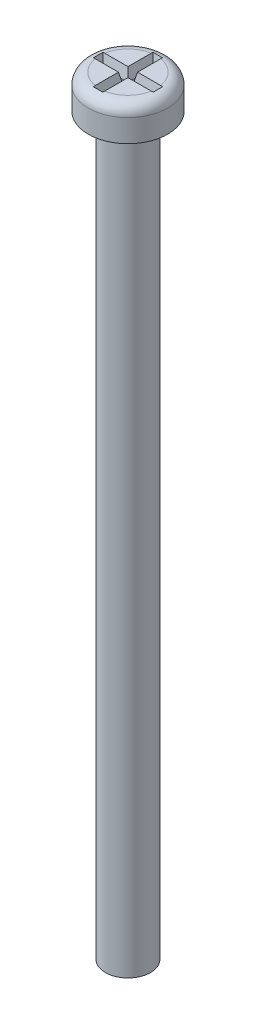
ISO-10303-21;
HEADER;
FILE_DESCRIPTION(('STEP AP214'),'2;1');
FILE_NAME('part.step','',(''),(''),'','','');
FILE_SCHEMA(('AUTOMOTIVE_DESIGN { 1 0 10303 214 1 1 1 1 }'));
ENDSEC;
DATA;
#1=APPLICATION_CONTEXT('core data for automotive mechanical design processes');
#2=APPLICATION_PROTOCOL_DEFINITION('international standard','automotive_design',2000,#1);
#3=PRODUCT_CONTEXT('',#1,'mechanical');
#4=PRODUCT('Part','Part','',(#3));
#5=PRODUCT_RELATED_PRODUCT_CATEGORY('part','',(#4));
#6=PRODUCT_DEFINITION_FORMATION('','',#4);
#7=PRODUCT_DEFINITION_CONTEXT('part definition',#1,'design');
#8=PRODUCT_DEFINITION('design','',#6,#7);
#9=PRODUCT_DEFINITION_SHAPE('','',#8);
#10=(LENGTH_UNIT() NAMED_UNIT(*) SI_UNIT(.MILLI.,.METRE.));
#11=(NAMED_UNIT(*) PLANE_ANGLE_UNIT() SI_UNIT($,.RADIAN.));
#12=(NAMED_UNIT(*) SI_UNIT($,.STERADIAN.) SOLID_ANGLE_UNIT());
#13=UNCERTAINTY_MEASURE_WITH_UNIT(LENGTH_MEASURE(1.E-05),#10,'distance_accuracy_value','');
#14=(GEOMETRIC_REPRESENTATION_CONTEXT(3) GLOBAL_UNCERTAINTY_ASSIGNED_CONTEXT((#13)) GLOBAL_UNIT_ASSIGNED_CONTEXT((#10,
#11,#12)) REPRESENTATION_CONTEXT('',''));
#15=CARTESIAN_POINT('',(0.,0.,0.));
#16=DIRECTION('',(0.,0.,1.));
#17=DIRECTION('',(1.,0.,0.));
#18=AXIS2_PLACEMENT_3D('',#15,#16,#17);
#19=CARTESIAN_POINT('',(0.,68.,0.));
#20=DIRECTION('',(0.,1.,0.));
#21=DIRECTION('',(0.,0.,1.));
#22=AXIS2_PLACEMENT_3D('',#19,#20,#21);
#23=PLANE('',#22);
#24=DIRECTION('',(-1.,0.,0.));
#25=VECTOR('',#24,1.);
#26=CARTESIAN_POINT('',(0.422769915905619,68.,-0.422769915905619));
#27=LINE('',#26,#25);
#28=CARTESIAN_POINT('',(2.47921168886506,68.,-0.422769915905619));
#29=VERTEX_POINT('',#28);
#30=CARTESIAN_POINT('',(0.422769915905619,68.,-0.422769915905619));
#31=VERTEX_POINT('',#30);
#32=EDGE_CURVE('E377',#29,#31,#27,.T.);
#33=ORIENTED_EDGE('',*,*,#32,.F.);
#34=CARTESIAN_POINT('',(0.,68.,0.));
#35=DIRECTION('',(0.,1.,0.));
#36=DIRECTION('',(0.,0.,1.));
#37=AXIS2_PLACEMENT_3D('',#34,#35,#36);
#38=CIRCLE('',#37,2.515);
#39=CARTESIAN_POINT('',(0.422769915905619,68.,-2.47921168886506));
#40=VERTEX_POINT('',#39);
#41=EDGE_CURVE('E263',#29,#40,#38,.T.);
#42=ORIENTED_EDGE('',*,*,#41,.T.);
#43=DIRECTION('',(0.,0.,-1.));
#44=VECTOR('',#43,1.);
#45=CARTESIAN_POINT('',(0.422769915905619,68.,-2.64154947271322));
#46=LINE('',#45,#44);
#47=EDGE_CURVE('E162',#31,#40,#46,.T.);
#48=ORIENTED_EDGE('',*,*,#47,.F.);
#49=EDGE_LOOP('',(#33,#42,#48));
#50=FACE_BOUND('',#49,.T.);
#51=ADVANCED_FACE('F35',(#50),#23,.T.);
#52=DIRECTION('',(0.,0.,1.));
#53=VECTOR('',#52,1.);
#54=CARTESIAN_POINT('',(-0.422769915905619,68.,-0.422769915905619));
#55=LINE('',#54,#53);
#56=CARTESIAN_POINT('',(-0.422769915905619,68.,-2.47921168886506));
#57=VERTEX_POINT('',#56);
#58=CARTESIAN_POINT('',(-0.422769915905619,68.,-0.422769915905619));
#59=VERTEX_POINT('',#58);
#60=EDGE_CURVE('E149',#57,#59,#55,.T.);
#61=ORIENTED_EDGE('',*,*,#60,.F.);
#62=CARTESIAN_POINT('',(0.,68.,0.));
#63=DIRECTION('',(0.,1.,0.));
#64=DIRECTION('',(0.,0.,1.));
#65=AXIS2_PLACEMENT_3D('',#62,#63,#64);
#66=CIRCLE('',#65,2.515);
#67=CARTESIAN_POINT('',(-2.47921168886506,68.,-0.422769915905619));
#68=VERTEX_POINT('',#67);
#69=EDGE_CURVE('E175',#57,#68,#66,.T.);
#70=ORIENTED_EDGE('',*,*,#69,.T.);
#71=DIRECTION('',(-1.,0.,0.));
#72=VECTOR('',#71,1.);
#73=CARTESIAN_POINT('',(-2.64154947271322,68.,-0.422769915905619));
#74=LINE('',#73,#72);
#75=EDGE_CURVE('E161',#59,#68,#74,.T.);
#76=ORIENTED_EDGE('',*,*,#75,.F.);
#77=EDGE_LOOP('',(#61,#70,#76));
#78=FACE_BOUND('',#77,.T.);
#79=ADVANCED_FACE('F174',(#78),#23,.T.);
#80=DIRECTION('',(1.,0.,0.));
#81=VECTOR('',#80,1.);
#82=CARTESIAN_POINT('',(-0.422769915905619,68.,0.422769915905619));
#83=LINE('',#82,#81);
#84=CARTESIAN_POINT('',(-2.47921168886506,68.,0.422769915905619));
#85=VERTEX_POINT('',#84);
#86=CARTESIAN_POINT('',(-0.422769915905619,68.,0.422769915905619));
#87=VERTEX_POINT('',#86);
#88=EDGE_CURVE('E176',#85,#87,#83,.T.);
#89=ORIENTED_EDGE('',*,*,#88,.F.);
#90=CARTESIAN_POINT('',(0.,68.,0.));
#91=DIRECTION('',(0.,1.,0.));
#92=DIRECTION('',(0.,0.,1.));
#93=AXIS2_PLACEMENT_3D('',#90,#91,#92);
#94=CIRCLE('',#93,2.515);
#95=CARTESIAN_POINT('',(-0.422769915905619,68.,2.47921168886506));
#96=VERTEX_POINT('',#95);
#97=EDGE_CURVE('E260',#85,#96,#94,.T.);
#98=ORIENTED_EDGE('',*,*,#97,.T.);
#99=DIRECTION('',(0.,0.,1.));
#100=VECTOR('',#99,1.);
#101=CARTESIAN_POINT('',(-0.422769915905619,68.,2.64154947271322));
#102=LINE('',#101,#100);
#103=EDGE_CURVE('E178',#87,#96,#102,.T.);
#104=ORIENTED_EDGE('',*,*,#103,.F.);
#105=EDGE_LOOP('',(#89,#98,#104));
#106=FACE_BOUND('',#105,.T.);
#107=ADVANCED_FACE('F407',(#106),#23,.T.);
#108=CARTESIAN_POINT('',(0.,65.,0.));
#109=DIRECTION('',(0.,-1.,0.));
#110=DIRECTION('',(0.,0.,-1.));
#111=AXIS2_PLACEMENT_3D('',#108,#109,#110);
#112=CYLINDRICAL_SURFACE('',#111,2.);
#113=CARTESIAN_POINT('',(0.,65.,0.));
#114=DIRECTION('',(0.,1.,0.));
#115=DIRECTION('',(0.,0.,1.));
#116=AXIS2_PLACEMENT_3D('',#113,#114,#115);
#117=CIRCLE('',#116,2.);
#118=CARTESIAN_POINT('',(0.,65.,2.));
#119=VERTEX_POINT('',#118);
#120=EDGE_CURVE('E253',#119,#119,#117,.T.);
#121=ORIENTED_EDGE('',*,*,#120,.F.);
#122=EDGE_LOOP('',(#121));
#123=FACE_BOUND('',#122,.T.);
#124=CARTESIAN_POINT('',(0.,0.,0.));
#125=DIRECTION('',(0.,1.,0.));
#126=DIRECTION('',(0.,0.,1.));
#127=AXIS2_PLACEMENT_3D('',#124,#125,#126);
#128=CIRCLE('',#127,2.);
#129=CARTESIAN_POINT('',(0.,0.,2.));
#130=VERTEX_POINT('',#129);
#131=EDGE_CURVE('E252',#130,#130,#128,.T.);
#132=ORIENTED_EDGE('',*,*,#131,.T.);
#133=EDGE_LOOP('',(#132));
#134=FACE_BOUND('',#133,.T.);
#135=ADVANCED_FACE('F412',(#123,#134),#112,.T.);
#136=CARTESIAN_POINT('',(0.,0.,0.));
#137=DIRECTION('',(0.,1.,0.));
#138=DIRECTION('',(0.,0.,1.));
#139=AXIS2_PLACEMENT_3D('',#136,#137,#138);
#140=PLANE('',#139);
#141=ORIENTED_EDGE('',*,*,#131,.F.);
#142=EDGE_LOOP('',(#141));
#143=FACE_BOUND('',#142,.T.);
#144=ADVANCED_FACE('F417',(#143),#140,.F.);
#145=CARTESIAN_POINT('',(0.,68.,0.));
#146=DIRECTION('',(0.,-1.,0.));
#147=DIRECTION('',(0.,0.,-1.));
#148=AXIS2_PLACEMENT_3D('',#145,#146,#147);
#149=CYLINDRICAL_SURFACE('',#148,3.515);
#150=CARTESIAN_POINT('',(0.,67.,0.));
#151=DIRECTION('',(0.,1.,0.));
#152=DIRECTION('',(0.,0.,1.));
#153=AXIS2_PLACEMENT_3D('',#150,#151,#152);
#154=CIRCLE('',#153,3.515);
#155=CARTESIAN_POINT('',(0.,67.,3.515));
#156=VERTEX_POINT('',#155);
#157=EDGE_CURVE('E11',#156,#156,#154,.F.);
#158=ORIENTED_EDGE('',*,*,#157,.T.);
#159=EDGE_LOOP('',(#158));
#160=FACE_BOUND('',#159,.T.);
#161=CARTESIAN_POINT('',(0.,65.,0.));
#162=DIRECTION('',(0.,1.,0.));
#163=DIRECTION('',(0.,0.,1.));
#164=AXIS2_PLACEMENT_3D('',#161,#162,#163);
#165=CIRCLE('',#164,3.515);
#166=CARTESIAN_POINT('',(0.,65.,3.515));
#167=VERTEX_POINT('',#166);
#168=EDGE_CURVE('E191',#167,#167,#165,.T.);
#169=ORIENTED_EDGE('',*,*,#168,.T.);
#170=EDGE_LOOP('',(#169));
#171=FACE_BOUND('',#170,.T.);
#172=ADVANCED_FACE('F421',(#160,#171),#149,.T.);
#173=DIRECTION('',(0.,0.,-1.));
#174=VECTOR('',#173,1.);
#175=CARTESIAN_POINT('',(0.422769915905619,68.,0.422769915905619));
#176=LINE('',#175,#174);
#177=CARTESIAN_POINT('',(0.422769915905619,68.,2.47921168886506));
#178=VERTEX_POINT('',#177);
#179=CARTESIAN_POINT('',(0.422769915905619,68.,0.422769915905619));
#180=VERTEX_POINT('',#179);
#181=EDGE_CURVE('E184',#178,#180,#176,.T.);
#182=ORIENTED_EDGE('',*,*,#181,.F.);
#183=CARTESIAN_POINT('',(0.,68.,0.));
#184=DIRECTION('',(0.,1.,0.));
#185=DIRECTION('',(0.,0.,1.));
#186=AXIS2_PLACEMENT_3D('',#183,#184,#185);
#187=CIRCLE('',#186,2.515);
#188=CARTESIAN_POINT('',(2.47921168886506,68.,0.422769915905619));
#189=VERTEX_POINT('',#188);
#190=EDGE_CURVE('E256',#178,#189,#187,.T.);
#191=ORIENTED_EDGE('',*,*,#190,.T.);
#192=DIRECTION('',(1.,0.,0.));
#193=VECTOR('',#192,1.);
#194=CARTESIAN_POINT('',(2.64154947271322,68.,0.422769915905619));
#195=LINE('',#194,#193);
#196=EDGE_CURVE('E186',#180,#189,#195,.T.);
#197=ORIENTED_EDGE('',*,*,#196,.F.);
#198=EDGE_LOOP('',(#182,#191,#197));
#199=FACE_BOUND('',#198,.T.);
#200=ADVANCED_FACE('F366',(#199),#23,.T.);
#201=CARTESIAN_POINT('',(0.,65.,0.));
#202=DIRECTION('',(0.,1.,0.));
#203=DIRECTION('',(0.,0.,1.));
#204=AXIS2_PLACEMENT_3D('',#201,#202,#203);
#205=PLANE('',#204);
#206=ORIENTED_EDGE('',*,*,#120,.T.);
#207=EDGE_LOOP('',(#206));
#208=FACE_BOUND('',#207,.T.);
#209=ORIENTED_EDGE('',*,*,#168,.F.);
#210=EDGE_LOOP('',(#209));
#211=FACE_BOUND('',#210,.T.);
#212=ADVANCED_FACE('F420',(#208,#211),#205,.F.);
#213=CARTESIAN_POINT('',(0.422769915905619,68.,-0.422769915905619));
#214=DIRECTION('',(0.,-0.207911690817759,-0.978147600733806));
#215=DIRECTION('',(0.,0.978147600733806,-0.207911690817759));
#216=AXIS2_PLACEMENT_3D('',#213,#214,#215);
#217=PLANE('',#216);
#218=DIRECTION('',(0.203558594952779,0.957667894857973,-0.203558594952779));
#219=VECTOR('',#218,1.);
#220=CARTESIAN_POINT('',(2.60651359835308,67.8351691705734,-0.387734041545471));
#221=LINE('',#220,#219);
#222=CARTESIAN_POINT('',(2.4289929110432,67.,-0.210213354235596));
#223=VERTEX_POINT('',#222);
#224=CARTESIAN_POINT('',(2.63890864587035,67.9875758865211,-0.420129089062742));
#225=VERTEX_POINT('',#224);
#226=EDGE_CURVE('E189',#223,#225,#221,.T.);
#227=ORIENTED_EDGE('',*,*,#226,.T.);
#228=CARTESIAN_POINT('',(2.63890864587035,67.9875758865211,-0.420129089062742));
#229=CARTESIAN_POINT('',(2.61246025382318,67.9917103029364,-0.421007886400498));
#230=CARTESIAN_POINT('',(2.58592795776817,67.9948128539393,-0.421667353974071));
#231=CARTESIAN_POINT('',(2.53269563825816,67.9989542188483,-0.422547628259755));
#232=CARTESIAN_POINT('',(2.50599561531141,67.9999930390051,-0.422768436300485));
#233=CARTESIAN_POINT('',(2.47921168886509,68.0000000000002,-0.422769915905651));
#234=B_SPLINE_CURVE_WITH_KNOTS('',3,(#228,#229,#230,#231,#232,#233),.UNSPECIFIED.,.F.,.F.,(4,2,
4),(0.,0.0801636519091339,0.160327061016981),.UNSPECIFIED.);
#235=EDGE_CURVE('E44',#225,#29,#234,.T.);
#236=ORIENTED_EDGE('',*,*,#235,.T.);
#237=ORIENTED_EDGE('',*,*,#32,.T.);
#238=DIRECTION('',(0.203558594952779,0.957667894857973,-0.203558594952779));
#239=VECTOR('',#238,1.);
#240=CARTESIAN_POINT('',(0.514707491003239,68.4325322839967,-0.514707491003239));
#241=LINE('',#240,#239);
#242=CARTESIAN_POINT('',(0.210213354235596,67.,-0.210213354235596));
#243=VERTEX_POINT('',#242);
#244=EDGE_CURVE('E193',#243,#31,#241,.T.);
#245=ORIENTED_EDGE('',*,*,#244,.F.);
#246=DIRECTION('',(-1.,0.,0.));
#247=VECTOR('',#246,1.);
#248=CARTESIAN_POINT('',(0.,67.,-0.210213354235596));
#249=LINE('',#248,#247);
#250=EDGE_CURVE('E188',#223,#243,#249,.T.);
#251=ORIENTED_EDGE('',*,*,#250,.F.);
#252=EDGE_LOOP('',(#227,#236,#237,#245,#251));
#253=FACE_BOUND('',#252,.T.);
#254=ADVANCED_FACE('F285',(#253),#217,.F.);
#255=CARTESIAN_POINT('',(2.64154947271322,68.,0.422769915905619));
#256=DIRECTION('',(0.978147600733806,-0.207911690817759,0.));
#257=DIRECTION('',(0.207911690817759,0.978147600733806,0.));
#258=AXIS2_PLACEMENT_3D('',#255,#256,#257);
#259=PLANE('',#258);
#260=DIRECTION('',(0.203558594952779,0.957667894857973,0.203558594952779));
#261=VECTOR('',#260,1.);
#262=CARTESIAN_POINT('',(2.64154947271322,68.,0.422769915905619));
#263=LINE('',#262,#261);
#264=CARTESIAN_POINT('',(2.4289929110432,67.,0.210213354235596));
#265=VERTEX_POINT('',#264);
#266=CARTESIAN_POINT('',(2.63890864587035,67.9875758865211,0.420129089062742));
#267=VERTEX_POINT('',#266);
#268=EDGE_CURVE('E192',#265,#267,#263,.T.);
#269=ORIENTED_EDGE('',*,*,#268,.T.);
#270=CARTESIAN_POINT('',(2.63890864587035,67.9875758865211,0.420129089062742));
#271=CARTESIAN_POINT('',(2.63926052612753,67.989231352974,0.350115794791614));
#272=CARTESIAN_POINT('',(2.63950472425311,67.9903802148282,0.280093037473652));
#273=CARTESIAN_POINT('',(2.63981715218977,67.9918500727061,0.140046852645141));
#274=CARTESIAN_POINT('',(2.6398854040906,67.9921711726538,0.0700234263225701));
#275=CARTESIAN_POINT('',(2.6398854040906,67.9921711726538,-0.070023426322571));
#276=CARTESIAN_POINT('',(2.63981715218977,67.9918500727061,-0.140046852645142));
#277=CARTESIAN_POINT('',(2.63950472425311,67.9903802148282,-0.280093037473653));
#278=CARTESIAN_POINT('',(2.63926052612753,67.989231352974,-0.350115794791615));
#279=CARTESIAN_POINT('',(2.63890864587035,67.9875758865211,-0.420129089062743));
#280=B_SPLINE_CURVE_WITH_KNOTS('',3,(#270,#271,#272,#273,#274,#275,#276,#277,#278,#279),
.UNSPECIFIED.,.F.,.F.,(4,2,2,2,4),(0.,0.21009470131438,0.420163024312073,0.630231347309767,
0.840326048624147),.UNSPECIFIED.);
#281=EDGE_CURVE('E51',#267,#225,#280,.T.);
#282=ORIENTED_EDGE('',*,*,#281,.T.);
#283=ORIENTED_EDGE('',*,*,#226,.F.);
#284=DIRECTION('',(0.,0.,-1.));
#285=VECTOR('',#284,1.);
#286=CARTESIAN_POINT('',(2.4289929110432,67.,0.));
#287=LINE('',#286,#285);
#288=EDGE_CURVE('E197',#265,#223,#287,.T.);
#289=ORIENTED_EDGE('',*,*,#288,.F.);
#290=EDGE_LOOP('',(#269,#282,#283,#289));
#291=FACE_BOUND('',#290,.T.);
#292=ADVANCED_FACE('F362',(#291),#259,.F.);
#293=CARTESIAN_POINT('',(2.64154947271322,68.,0.422769915905619));
#294=DIRECTION('',(0.,-0.207911690817759,0.978147600733806));
#295=DIRECTION('',(0.,-0.978147600733806,-0.207911690817759));
#296=AXIS2_PLACEMENT_3D('',#293,#294,#295);
#297=PLANE('',#296);
#298=ORIENTED_EDGE('',*,*,#196,.T.);
#299=CARTESIAN_POINT('',(2.47921168886506,68.,0.422769915905619));
#300=CARTESIAN_POINT('',(2.50599561531139,67.9999930390051,0.422768436300468));
#301=CARTESIAN_POINT('',(2.53269563825815,67.9989542188483,0.422547628259749));
#302=CARTESIAN_POINT('',(2.58592795776817,67.9948128539393,0.421667353974077));
#303=CARTESIAN_POINT('',(2.61246025382318,67.9917103029365,0.421007886400505));
#304=CARTESIAN_POINT('',(2.63890864587035,67.9875758865211,0.420129089062746));
#305=B_SPLINE_CURVE_WITH_KNOTS('',3,(#299,#300,#301,#302,#303,#304),.UNSPECIFIED.,.F.,.F.,(4,2,
4),(0.,0.0801634091078588,0.160327061016996),.UNSPECIFIED.);
#306=EDGE_CURVE('E59',#189,#267,#305,.T.);
#307=ORIENTED_EDGE('',*,*,#306,.T.);
#308=ORIENTED_EDGE('',*,*,#268,.F.);
#309=DIRECTION('',(1.,0.,0.));
#310=VECTOR('',#309,1.);
#311=CARTESIAN_POINT('',(0.,67.,0.210213354235596));
#312=LINE('',#311,#310);
#313=CARTESIAN_POINT('',(0.210213354235596,67.,0.210213354235596));
#314=VERTEX_POINT('',#313);
#315=EDGE_CURVE('E224',#314,#265,#312,.T.);
#316=ORIENTED_EDGE('',*,*,#315,.F.);
#317=DIRECTION('',(0.203558594952779,0.957667894857973,0.203558594952779));
#318=VECTOR('',#317,1.);
#319=CARTESIAN_POINT('',(0.514707491003239,68.4325322839967,0.514707491003239));
#320=LINE('',#319,#318);
#321=EDGE_CURVE('E215',#314,#180,#320,.T.);
#322=ORIENTED_EDGE('',*,*,#321,.T.);
#323=EDGE_LOOP('',(#298,#307,#308,#316,#322));
#324=FACE_BOUND('',#323,.T.);
#325=ADVANCED_FACE('F357',(#324),#297,.F.);
#326=CARTESIAN_POINT('',(0.422769915905619,68.,0.422769915905619));
#327=DIRECTION('',(0.978147600733806,-0.207911690817759,0.));
#328=DIRECTION('',(0.207911690817759,0.978147600733806,0.));
#329=AXIS2_PLACEMENT_3D('',#326,#327,#328);
#330=PLANE('',#329);
#331=DIRECTION('',(0.203558594952779,0.957667894857973,0.203558594952779));
#332=VECTOR('',#331,1.);
#333=CARTESIAN_POINT('',(0.387734041545471,67.8351691705734,2.60651359835307));
#334=LINE('',#333,#332);
#335=CARTESIAN_POINT('',(0.210213354235596,67.,2.4289929110432));
#336=VERTEX_POINT('',#335);
#337=CARTESIAN_POINT('',(0.420129089062742,67.9875758865211,2.63890864587035));
#338=VERTEX_POINT('',#337);
#339=EDGE_CURVE('E212',#336,#338,#334,.T.);
#340=ORIENTED_EDGE('',*,*,#339,.T.);
#341=CARTESIAN_POINT('',(0.420129089062742,67.9875758865211,2.63890864587035));
#342=CARTESIAN_POINT('',(0.421007886400498,67.9917103029364,2.61246025382318));
#343=CARTESIAN_POINT('',(0.421667353974071,67.9948128539393,2.58592795776817));
#344=CARTESIAN_POINT('',(0.422547628259755,67.9989542188483,2.53269563825816));
#345=CARTESIAN_POINT('',(0.422768436300485,67.9999930390051,2.50599561531141));
#346=CARTESIAN_POINT('',(0.422769915905651,68.0000000000002,2.47921168886509));
#347=B_SPLINE_CURVE_WITH_KNOTS('',3,(#341,#342,#343,#344,#345,#346),.UNSPECIFIED.,.F.,.F.,(4,2,
4),(0.,0.0801636519091331,0.16032706101698),.UNSPECIFIED.);
#348=EDGE_CURVE('E344',#338,#178,#347,.T.);
#349=ORIENTED_EDGE('',*,*,#348,.T.);
#350=ORIENTED_EDGE('',*,*,#181,.T.);
#351=ORIENTED_EDGE('',*,*,#321,.F.);
#352=DIRECTION('',(0.,0.,-1.));
#353=VECTOR('',#352,1.);
#354=CARTESIAN_POINT('',(0.210213354235596,67.,0.));
#355=LINE('',#354,#353);
#356=EDGE_CURVE('E227',#336,#314,#355,.T.);
#357=ORIENTED_EDGE('',*,*,#356,.F.);
#358=EDGE_LOOP('',(#340,#349,#350,#351,#357));
#359=FACE_BOUND('',#358,.T.);
#360=ADVANCED_FACE('F354',(#359),#330,.F.);
#361=CARTESIAN_POINT('',(-0.422769915905619,68.,2.64154947271322));
#362=DIRECTION('',(0.,-0.207911690817759,0.978147600733806));
#363=DIRECTION('',(0.,-0.978147600733806,-0.207911690817759));
#364=AXIS2_PLACEMENT_3D('',#361,#362,#363);
#365=PLANE('',#364);
#366=DIRECTION('',(-0.203558594952779,0.957667894857973,0.203558594952779));
#367=VECTOR('',#366,1.);
#368=CARTESIAN_POINT('',(-0.422769915905619,68.,2.64154947271322));
#369=LINE('',#368,#367);
#370=CARTESIAN_POINT('',(-0.210213354235597,67.,2.4289929110432));
#371=VERTEX_POINT('',#370);
#372=CARTESIAN_POINT('',(-0.420129089062742,67.9875758865211,2.63890864587034));
#373=VERTEX_POINT('',#372);
#374=EDGE_CURVE('E209',#371,#373,#369,.T.);
#375=ORIENTED_EDGE('',*,*,#374,.T.);
#376=CARTESIAN_POINT('',(-0.420129089062742,67.9875758865211,2.63890864587034));
#377=CARTESIAN_POINT('',(-0.350115794791614,67.989231352974,2.63926052612753));
#378=CARTESIAN_POINT('',(-0.280093037473652,67.9903802148282,2.63950472425311));
#379=CARTESIAN_POINT('',(-0.140046852645141,67.9918500727061,2.63981715218977));
#380=CARTESIAN_POINT('',(-0.0700234263225703,67.9921711726538,2.6398854040906));
#381=CARTESIAN_POINT('',(0.0700234263225708,67.9921711726538,2.6398854040906));
#382=CARTESIAN_POINT('',(0.140046852645141,67.9918500727061,2.63981715218977));
#383=CARTESIAN_POINT('',(0.280093037473652,67.9903802148282,2.63950472425311));
#384=CARTESIAN_POINT('',(0.350115794791615,67.989231352974,2.63926052612753));
#385=CARTESIAN_POINT('',(0.420129089062742,67.9875758865211,2.63890864587035));
#386=B_SPLINE_CURVE_WITH_KNOTS('',3,(#376,#377,#378,#379,#380,#381,#382,#383,#384,#385),
.UNSPECIFIED.,.F.,.F.,(4,2,2,2,4),(0.,0.21009470131438,0.420163024312073,0.630231347309767,
0.840326048624147),.UNSPECIFIED.);
#387=EDGE_CURVE('E339',#373,#338,#386,.T.);
#388=ORIENTED_EDGE('',*,*,#387,.T.);
#389=ORIENTED_EDGE('',*,*,#339,.F.);
#390=DIRECTION('',(1.,0.,0.));
#391=VECTOR('',#390,1.);
#392=CARTESIAN_POINT('',(0.,67.,2.4289929110432));
#393=LINE('',#392,#391);
#394=EDGE_CURVE('E230',#371,#336,#393,.T.);
#395=ORIENTED_EDGE('',*,*,#394,.F.);
#396=EDGE_LOOP('',(#375,#388,#389,#395));
#397=FACE_BOUND('',#396,.T.);
#398=ADVANCED_FACE('F330',(#397),#365,.F.);
#399=CARTESIAN_POINT('',(-0.422769915905619,68.,2.64154947271322));
#400=DIRECTION('',(-0.978147600733806,-0.207911690817759,0.));
#401=DIRECTION('',(0.207911690817759,-0.978147600733806,0.));
#402=AXIS2_PLACEMENT_3D('',#399,#400,#401);
#403=PLANE('',#402);
#404=ORIENTED_EDGE('',*,*,#103,.T.);
#405=CARTESIAN_POINT('',(-0.422769915905619,68.,2.47921168886506));
#406=CARTESIAN_POINT('',(-0.422768436300468,67.9999930390051,2.50599561531139));
#407=CARTESIAN_POINT('',(-0.422547628259749,67.9989542188483,2.53269563825815));
#408=CARTESIAN_POINT('',(-0.421667353974077,67.9948128539393,2.58592795776817));
#409=CARTESIAN_POINT('',(-0.421007886400505,67.9917103029365,2.61246025382318));
#410=CARTESIAN_POINT('',(-0.420129089062747,67.9875758865211,2.63890864587034));
#411=B_SPLINE_CURVE_WITH_KNOTS('',3,(#405,#406,#407,#408,#409,#410),.UNSPECIFIED.,.F.,.F.,(4,2,
4),(0.,0.0801634091078588,0.160327061016995),.UNSPECIFIED.);
#412=EDGE_CURVE('E334',#96,#373,#411,.T.);
#413=ORIENTED_EDGE('',*,*,#412,.T.);
#414=ORIENTED_EDGE('',*,*,#374,.F.);
#415=DIRECTION('',(0.,0.,1.));
#416=VECTOR('',#415,1.);
#417=CARTESIAN_POINT('',(-0.210213354235596,67.,0.));
#418=LINE('',#417,#416);
#419=CARTESIAN_POINT('',(-0.210213354235596,67.,0.210213354235596));
#420=VERTEX_POINT('',#419);
#421=EDGE_CURVE('E233',#420,#371,#418,.T.);
#422=ORIENTED_EDGE('',*,*,#421,.F.);
#423=DIRECTION('',(-0.203558594952779,0.957667894857973,0.203558594952779));
#424=VECTOR('',#423,1.);
#425=CARTESIAN_POINT('',(-0.514707491003239,68.4325322839967,0.514707491003239));
#426=LINE('',#425,#424);
#427=EDGE_CURVE('E206',#420,#87,#426,.T.);
#428=ORIENTED_EDGE('',*,*,#427,.T.);
#429=EDGE_LOOP('',(#404,#413,#414,#422,#428));
#430=FACE_BOUND('',#429,.T.);
#431=ADVANCED_FACE('F325',(#430),#403,.F.);
#432=CARTESIAN_POINT('',(-0.422769915905619,68.,0.422769915905619));
#433=DIRECTION('',(0.,-0.207911690817759,0.978147600733806));
#434=DIRECTION('',(0.,-0.978147600733806,-0.207911690817759));
#435=AXIS2_PLACEMENT_3D('',#432,#433,#434);
#436=PLANE('',#435);
#437=DIRECTION('',(-0.203558594952779,0.957667894857973,0.203558594952779));
#438=VECTOR('',#437,1.);
#439=CARTESIAN_POINT('',(-2.64154947271322,68.,0.422769915905619));
#440=LINE('',#439,#438);
#441=CARTESIAN_POINT('',(-2.4289929110432,67.,0.210213354235596));
#442=VERTEX_POINT('',#441);
#443=CARTESIAN_POINT('',(-2.63890864587035,67.9875758865211,0.420129089062742));
#444=VERTEX_POINT('',#443);
#445=EDGE_CURVE('E203',#442,#444,#440,.T.);
#446=ORIENTED_EDGE('',*,*,#445,.T.);
#447=CARTESIAN_POINT('',(-2.63890864587035,67.9875758865211,0.420129089062742));
#448=CARTESIAN_POINT('',(-2.61246025382318,67.9917103029364,0.421007886400497));
#449=CARTESIAN_POINT('',(-2.58592795776817,67.9948128539393,0.421667353974071));
#450=CARTESIAN_POINT('',(-2.53269563825816,67.9989542188483,0.422547628259755));
#451=CARTESIAN_POINT('',(-2.50599561531141,67.9999930390051,0.422768436300485));
#452=CARTESIAN_POINT('',(-2.47921168886509,68.0000000000002,0.422769915905651));
#453=B_SPLINE_CURVE_WITH_KNOTS('',3,(#447,#448,#449,#450,#451,#452),.UNSPECIFIED.,.F.,.F.,(4,2,
4),(0.,0.0801636519091331,0.16032706101698),.UNSPECIFIED.);
#454=EDGE_CURVE('E311',#444,#85,#453,.T.);
#455=ORIENTED_EDGE('',*,*,#454,.T.);
#456=ORIENTED_EDGE('',*,*,#88,.T.);
#457=ORIENTED_EDGE('',*,*,#427,.F.);
#458=DIRECTION('',(1.,0.,0.));
#459=VECTOR('',#458,1.);
#460=CARTESIAN_POINT('',(0.,67.,0.210213354235596));
#461=LINE('',#460,#459);
#462=EDGE_CURVE('E236',#442,#420,#461,.T.);
#463=ORIENTED_EDGE('',*,*,#462,.F.);
#464=EDGE_LOOP('',(#446,#455,#456,#457,#463));
#465=FACE_BOUND('',#464,.T.);
#466=ADVANCED_FACE('F320',(#465),#436,.F.);
#467=CARTESIAN_POINT('',(-2.64154947271322,68.,0.422769915905619));
#468=DIRECTION('',(-0.978147600733806,-0.207911690817759,0.));
#469=DIRECTION('',(0.207911690817759,-0.978147600733806,0.));
#470=AXIS2_PLACEMENT_3D('',#467,#468,#469);
#471=PLANE('',#470);
#472=DIRECTION('',(-0.203558594952779,0.957667894857973,-0.203558594952779));
#473=VECTOR('',#472,1.);
#474=CARTESIAN_POINT('',(-2.64154947271322,68.,-0.422769915905619));
#475=LINE('',#474,#473);
#476=CARTESIAN_POINT('',(-2.4289929110432,67.,-0.210213354235596));
#477=VERTEX_POINT('',#476);
#478=CARTESIAN_POINT('',(-2.63890864587035,67.9875758865211,-0.420129089062742));
#479=VERTEX_POINT('',#478);
#480=EDGE_CURVE('E171',#477,#479,#475,.T.);
#481=ORIENTED_EDGE('',*,*,#480,.T.);
#482=CARTESIAN_POINT('',(-2.63890864587035,67.9875758865211,-0.420129089062742));
#483=CARTESIAN_POINT('',(-2.63926052612753,67.989231352974,-0.350115794791614));
#484=CARTESIAN_POINT('',(-2.63950472425311,67.9903802148282,-0.280093037473652));
#485=CARTESIAN_POINT('',(-2.63981715218977,67.9918500727061,-0.140046852645141));
#486=CARTESIAN_POINT('',(-2.6398854040906,67.9921711726538,-0.0700234263225703));
#487=CARTESIAN_POINT('',(-2.6398854040906,67.9921711726538,0.0700234263225706));
#488=CARTESIAN_POINT('',(-2.63981715218977,67.9918500727061,0.140046852645141));
#489=CARTESIAN_POINT('',(-2.63950472425311,67.9903802148282,0.280093037473652));
#490=CARTESIAN_POINT('',(-2.63926052612753,67.989231352974,0.350115794791615));
#491=CARTESIAN_POINT('',(-2.63890864587035,67.9875758865211,0.420129089062742));
#492=B_SPLINE_CURVE_WITH_KNOTS('',3,(#482,#483,#484,#485,#486,#487,#488,#489,#490,#491),
.UNSPECIFIED.,.F.,.F.,(4,2,2,2,4),(0.,0.21009470131438,0.420163024312073,0.630231347309766,
0.840326048624146),.UNSPECIFIED.);
#493=EDGE_CURVE('E306',#479,#444,#492,.T.);
#494=ORIENTED_EDGE('',*,*,#493,.T.);
#495=ORIENTED_EDGE('',*,*,#445,.F.);
#496=DIRECTION('',(0.,0.,1.));
#497=VECTOR('',#496,1.);
#498=CARTESIAN_POINT('',(-2.4289929110432,67.,0.));
#499=LINE('',#498,#497);
#500=EDGE_CURVE('E239',#477,#442,#499,.T.);
#501=ORIENTED_EDGE('',*,*,#500,.F.);
#502=EDGE_LOOP('',(#481,#494,#495,#501));
#503=FACE_BOUND('',#502,.T.);
#504=ADVANCED_FACE('F317',(#503),#471,.F.);
#505=CARTESIAN_POINT('',(-2.64154947271322,68.,-0.422769915905619));
#506=DIRECTION('',(0.,-0.207911690817759,-0.978147600733806));
#507=DIRECTION('',(0.,0.978147600733806,-0.207911690817759));
#508=AXIS2_PLACEMENT_3D('',#505,#506,#507);
#509=PLANE('',#508);
#510=ORIENTED_EDGE('',*,*,#75,.T.);
#511=CARTESIAN_POINT('',(-2.47921168886506,68.,-0.422769915905619));
#512=CARTESIAN_POINT('',(-2.50599561531139,67.9999930390051,-0.422768436300468));
#513=CARTESIAN_POINT('',(-2.53269563825815,67.9989542188483,-0.422547628259749));
#514=CARTESIAN_POINT('',(-2.58592795776817,67.9948128539393,-0.421667353974077));
#515=CARTESIAN_POINT('',(-2.61246025382318,67.9917103029365,-0.421007886400505));
#516=CARTESIAN_POINT('',(-2.63890864587035,67.9875758865211,-0.420129089062746));
#517=B_SPLINE_CURVE_WITH_KNOTS('',3,(#511,#512,#513,#514,#515,#516),.UNSPECIFIED.,.F.,.F.,(4,2,
4),(0.,0.0801634091078588,0.160327061016996),.UNSPECIFIED.);
#518=EDGE_CURVE('E301',#68,#479,#517,.T.);
#519=ORIENTED_EDGE('',*,*,#518,.T.);
#520=ORIENTED_EDGE('',*,*,#480,.F.);
#521=DIRECTION('',(-1.,0.,0.));
#522=VECTOR('',#521,1.);
#523=CARTESIAN_POINT('',(0.,67.,-0.210213354235596));
#524=LINE('',#523,#522);
#525=CARTESIAN_POINT('',(-0.210213354235596,67.,-0.210213354235596));
#526=VERTEX_POINT('',#525);
#527=EDGE_CURVE('E169',#526,#477,#524,.T.);
#528=ORIENTED_EDGE('',*,*,#527,.F.);
#529=DIRECTION('',(-0.203558594952779,0.957667894857973,-0.203558594952779));
#530=VECTOR('',#529,1.);
#531=CARTESIAN_POINT('',(-0.514707491003239,68.4325322839967,-0.514707491003239));
#532=LINE('',#531,#530);
#533=EDGE_CURVE('E154',#526,#59,#532,.T.);
#534=ORIENTED_EDGE('',*,*,#533,.T.);
#535=EDGE_LOOP('',(#510,#519,#520,#528,#534));
#536=FACE_BOUND('',#535,.T.);
#537=ADVANCED_FACE('F166',(#536),#509,.F.);
#538=CARTESIAN_POINT('',(-0.422769915905619,68.,-0.422769915905619));
#539=DIRECTION('',(-0.978147600733806,-0.207911690817759,0.));
#540=DIRECTION('',(0.207911690817759,-0.978147600733806,0.));
#541=AXIS2_PLACEMENT_3D('',#538,#539,#540);
#542=PLANE('',#541);
#543=DIRECTION('',(-0.203558594952779,0.957667894857973,-0.203558594952779));
#544=VECTOR('',#543,1.);
#545=CARTESIAN_POINT('',(-0.422769915905619,68.,-2.64154947271322));
#546=LINE('',#545,#544);
#547=CARTESIAN_POINT('',(-0.210213354235597,67.,-2.4289929110432));
#548=VERTEX_POINT('',#547);
#549=CARTESIAN_POINT('',(-0.420129089062742,67.9875758865211,-2.63890864587035));
#550=VERTEX_POINT('',#549);
#551=EDGE_CURVE('E172',#548,#550,#546,.T.);
#552=ORIENTED_EDGE('',*,*,#551,.T.);
#553=CARTESIAN_POINT('',(-0.420129089062742,67.9875758865211,-2.63890864587035));
#554=CARTESIAN_POINT('',(-0.421007886400498,67.9917103029364,-2.61246025382318));
#555=CARTESIAN_POINT('',(-0.421667353974071,67.9948128539393,-2.58592795776817));
#556=CARTESIAN_POINT('',(-0.422547628259756,67.9989542188483,-2.53269563825816));
#557=CARTESIAN_POINT('',(-0.422768436300485,67.9999930390051,-2.50599561531141));
#558=CARTESIAN_POINT('',(-0.422769915905652,68.0000000000002,-2.47921168886509));
#559=B_SPLINE_CURVE_WITH_KNOTS('',3,(#553,#554,#555,#556,#557,#558),.UNSPECIFIED.,.F.,.F.,(4,2,
4),(0.,0.0801636519091339,0.160327061016981),.UNSPECIFIED.);
#560=EDGE_CURVE('E157',#550,#57,#559,.T.);
#561=ORIENTED_EDGE('',*,*,#560,.T.);
#562=ORIENTED_EDGE('',*,*,#60,.T.);
#563=ORIENTED_EDGE('',*,*,#533,.F.);
#564=DIRECTION('',(0.,0.,1.));
#565=VECTOR('',#564,1.);
#566=CARTESIAN_POINT('',(-0.210213354235596,67.,0.));
#567=LINE('',#566,#565);
#568=EDGE_CURVE('E243',#548,#526,#567,.T.);
#569=ORIENTED_EDGE('',*,*,#568,.F.);
#570=EDGE_LOOP('',(#552,#561,#562,#563,#569));
#571=FACE_BOUND('',#570,.T.);
#572=ADVANCED_FACE('F152',(#571),#542,.F.);
#573=CARTESIAN_POINT('',(-0.422769915905619,68.,-2.64154947271322));
#574=DIRECTION('',(0.,-0.207911690817759,-0.978147600733806));
#575=DIRECTION('',(0.,0.978147600733806,-0.207911690817759));
#576=AXIS2_PLACEMENT_3D('',#573,#574,#575);
#577=PLANE('',#576);
#578=DIRECTION('',(0.203558594952779,0.957667894857973,-0.203558594952779));
#579=VECTOR('',#578,1.);
#580=CARTESIAN_POINT('',(0.422769915905619,68.,-2.64154947271322));
#581=LINE('',#580,#579);
#582=CARTESIAN_POINT('',(0.210213354235596,67.,-2.4289929110432));
#583=VERTEX_POINT('',#582);
#584=CARTESIAN_POINT('',(0.420129089062742,67.9875758865211,-2.63890864587035));
#585=VERTEX_POINT('',#584);
#586=EDGE_CURVE('E196',#583,#585,#581,.T.);
#587=ORIENTED_EDGE('',*,*,#586,.T.);
#588=CARTESIAN_POINT('',(0.420129089062742,67.9875758865211,-2.63890864587035));
#589=CARTESIAN_POINT('',(0.350115794791614,67.989231352974,-2.63926052612753));
#590=CARTESIAN_POINT('',(0.280093037473652,67.9903802148282,-2.63950472425311));
#591=CARTESIAN_POINT('',(0.140046852645141,67.9918500727061,-2.63981715218977));
#592=CARTESIAN_POINT('',(0.0700234263225702,67.9921711726538,-2.6398854040906));
#593=CARTESIAN_POINT('',(-0.0700234263225707,67.9921711726538,-2.6398854040906));
#594=CARTESIAN_POINT('',(-0.140046852645141,67.9918500727061,-2.63981715218977));
#595=CARTESIAN_POINT('',(-0.280093037473652,67.9903802148282,-2.63950472425311));
#596=CARTESIAN_POINT('',(-0.350115794791615,67.989231352974,-2.63926052612753));
#597=CARTESIAN_POINT('',(-0.420129089062742,67.9875758865211,-2.63890864587035));
#598=B_SPLINE_CURVE_WITH_KNOTS('',3,(#588,#589,#590,#591,#592,#593,#594,#595,#596,#597),
.UNSPECIFIED.,.F.,.F.,(4,2,2,2,4),(0.,0.21009470131438,0.420163024312073,0.630231347309766,
0.840326048624146),.UNSPECIFIED.);
#599=EDGE_CURVE('E272',#585,#550,#598,.T.);
#600=ORIENTED_EDGE('',*,*,#599,.T.);
#601=ORIENTED_EDGE('',*,*,#551,.F.);
#602=DIRECTION('',(-1.,0.,0.));
#603=VECTOR('',#602,1.);
#604=CARTESIAN_POINT('',(0.,67.,-2.4289929110432));
#605=LINE('',#604,#603);
#606=EDGE_CURVE('E245',#583,#548,#605,.T.);
#607=ORIENTED_EDGE('',*,*,#606,.F.);
#608=EDGE_LOOP('',(#587,#600,#601,#607));
#609=FACE_BOUND('',#608,.T.);
#610=ADVANCED_FACE('F283',(#609),#577,.F.);
#611=CARTESIAN_POINT('',(0.422769915905619,68.,-2.64154947271322));
#612=DIRECTION('',(0.978147600733806,-0.207911690817759,0.));
#613=DIRECTION('',(0.207911690817759,0.978147600733806,0.));
#614=AXIS2_PLACEMENT_3D('',#611,#612,#613);
#615=PLANE('',#614);
#616=ORIENTED_EDGE('',*,*,#47,.T.);
#617=CARTESIAN_POINT('',(0.422769915905619,68.,-2.47921168886506));
#618=CARTESIAN_POINT('',(0.422768436300468,67.9999930390051,-2.5059956153114));
#619=CARTESIAN_POINT('',(0.422547628259749,67.9989542188483,-2.53269563825815));
#620=CARTESIAN_POINT('',(0.421667353974077,67.9948128539393,-2.58592795776817));
#621=CARTESIAN_POINT('',(0.421007886400505,67.9917103029365,-2.61246025382318));
#622=CARTESIAN_POINT('',(0.420129089062746,67.9875758865211,-2.63890864587035));
#623=B_SPLINE_CURVE_WITH_KNOTS('',3,(#617,#618,#619,#620,#621,#622),.UNSPECIFIED.,.F.,.F.,(4,2,
4),(0.,0.0801634091078596,0.160327061016997),.UNSPECIFIED.);
#624=EDGE_CURVE('E266',#40,#585,#623,.T.);
#625=ORIENTED_EDGE('',*,*,#624,.T.);
#626=ORIENTED_EDGE('',*,*,#586,.F.);
#627=DIRECTION('',(0.,0.,-1.));
#628=VECTOR('',#627,1.);
#629=CARTESIAN_POINT('',(0.210213354235596,67.,0.));
#630=LINE('',#629,#628);
#631=EDGE_CURVE('E221',#243,#583,#630,.T.);
#632=ORIENTED_EDGE('',*,*,#631,.F.);
#633=ORIENTED_EDGE('',*,*,#244,.T.);
#634=EDGE_LOOP('',(#616,#625,#626,#632,#633));
#635=FACE_BOUND('',#634,.T.);
#636=ADVANCED_FACE('F278',(#635),#615,.F.);
#637=CARTESIAN_POINT('',(0.,67.,0.));
#638=DIRECTION('',(0.,1.,0.));
#639=DIRECTION('',(0.,0.,1.));
#640=AXIS2_PLACEMENT_3D('',#637,#638,#639);
#641=PLANE('',#640);
#642=ORIENTED_EDGE('',*,*,#250,.T.);
#643=ORIENTED_EDGE('',*,*,#631,.T.);
#644=ORIENTED_EDGE('',*,*,#606,.T.);
#645=ORIENTED_EDGE('',*,*,#568,.T.);
#646=ORIENTED_EDGE('',*,*,#527,.T.);
#647=ORIENTED_EDGE('',*,*,#500,.T.);
#648=ORIENTED_EDGE('',*,*,#462,.T.);
#649=ORIENTED_EDGE('',*,*,#421,.T.);
#650=ORIENTED_EDGE('',*,*,#394,.T.);
#651=ORIENTED_EDGE('',*,*,#356,.T.);
#652=ORIENTED_EDGE('',*,*,#315,.T.);
#653=ORIENTED_EDGE('',*,*,#288,.T.);
#654=EDGE_LOOP('',(#642,#643,#644,#645,#646,#647,#648,#649,#650,#651,#652,#653));
#655=FACE_BOUND('',#654,.T.);
#656=ADVANCED_FACE('F282',(#655),#641,.T.);
#657=CARTESIAN_POINT('',(0.,67.,0.));
#658=DIRECTION('',(0.,1.,0.));
#659=DIRECTION('',(0.,0.,1.));
#660=AXIS2_PLACEMENT_3D('',#657,#658,#659);
#661=TOROIDAL_SURFACE('',#660,2.515,1.);
#662=ORIENTED_EDGE('',*,*,#157,.F.);
#663=EDGE_LOOP('',(#662));
#664=FACE_BOUND('',#663,.T.);
#665=ORIENTED_EDGE('',*,*,#624,.F.);
#666=ORIENTED_EDGE('',*,*,#41,.F.);
#667=ORIENTED_EDGE('',*,*,#235,.F.);
#668=ORIENTED_EDGE('',*,*,#281,.F.);
#669=ORIENTED_EDGE('',*,*,#306,.F.);
#670=ORIENTED_EDGE('',*,*,#190,.F.);
#671=ORIENTED_EDGE('',*,*,#348,.F.);
#672=ORIENTED_EDGE('',*,*,#387,.F.);
#673=ORIENTED_EDGE('',*,*,#412,.F.);
#674=ORIENTED_EDGE('',*,*,#97,.F.);
#675=ORIENTED_EDGE('',*,*,#454,.F.);
#676=ORIENTED_EDGE('',*,*,#493,.F.);
#677=ORIENTED_EDGE('',*,*,#518,.F.);
#678=ORIENTED_EDGE('',*,*,#69,.F.);
#679=ORIENTED_EDGE('',*,*,#560,.F.);
#680=ORIENTED_EDGE('',*,*,#599,.F.);
#681=EDGE_LOOP('',(#665,#666,#667,#668,#669,#670,#671,#672,#673,#674,#675,#676,#677,#678,#679,#680));
#682=FACE_BOUND('',#681,.T.);
#683=ADVANCED_FACE('F37',(#664,#682),#661,.T.);
#684=CLOSED_SHELL('',(#51,#79,#107,#135,#144,#172,#200,#212,#254,#292,#325,#360,#398,#431,#466,
#504,#537,#572,#610,#636,#656,#683));
#685=MANIFOLD_SOLID_BREP('B2',#684);
#686=ADVANCED_BREP_SHAPE_REPRESENTATION('',(#18,#685),#14);
#687=SHAPE_DEFINITION_REPRESENTATION(#9,#686);
ENDSEC;
END-ISO-10303-21;
